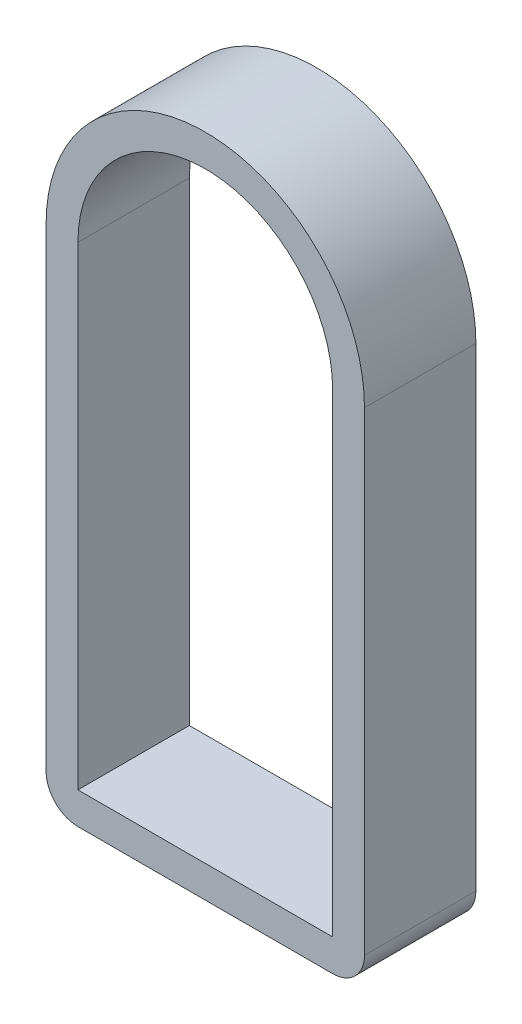
ISO-10303-21;
HEADER;
FILE_DESCRIPTION(('STEP AP214'),'2;1');
FILE_NAME('part.step','',(''),(''),'','','');
FILE_SCHEMA(('AUTOMOTIVE_DESIGN { 1 0 10303 214 1 1 1 1 }'));
ENDSEC;
DATA;
#1=APPLICATION_CONTEXT('core data for automotive mechanical design processes');
#2=APPLICATION_PROTOCOL_DEFINITION('international standard','automotive_design',2000,#1);
#3=PRODUCT_CONTEXT('',#1,'mechanical');
#4=PRODUCT('Part','Part','',(#3));
#5=PRODUCT_RELATED_PRODUCT_CATEGORY('part','',(#4));
#6=PRODUCT_DEFINITION_FORMATION('','',#4);
#7=PRODUCT_DEFINITION_CONTEXT('part definition',#1,'design');
#8=PRODUCT_DEFINITION('design','',#6,#7);
#9=PRODUCT_DEFINITION_SHAPE('','',#8);
#10=(LENGTH_UNIT() NAMED_UNIT(*) SI_UNIT(.MILLI.,.METRE.));
#11=(NAMED_UNIT(*) PLANE_ANGLE_UNIT() SI_UNIT($,.RADIAN.));
#12=(NAMED_UNIT(*) SI_UNIT($,.STERADIAN.) SOLID_ANGLE_UNIT());
#13=UNCERTAINTY_MEASURE_WITH_UNIT(LENGTH_MEASURE(1.E-05),#10,'distance_accuracy_value','');
#14=(GEOMETRIC_REPRESENTATION_CONTEXT(3) GLOBAL_UNCERTAINTY_ASSIGNED_CONTEXT((#13)) GLOBAL_UNIT_ASSIGNED_CONTEXT((#10,
#11,#12)) REPRESENTATION_CONTEXT('',''));
#15=CARTESIAN_POINT('',(0.,0.,0.));
#16=DIRECTION('',(0.,0.,1.));
#17=DIRECTION('',(1.,0.,0.));
#18=AXIS2_PLACEMENT_3D('',#15,#16,#17);
#19=CARTESIAN_POINT('',(0.,-5.71500000000012,0.));
#20=DIRECTION('',(0.,0.,1.));
#21=DIRECTION('',(1.,0.,0.));
#22=AXIS2_PLACEMENT_3D('',#19,#20,#21);
#23=CYLINDRICAL_SURFACE('',#22,1.);
#24=CARTESIAN_POINT('',(0.,-5.71500000000012,3.5));
#25=DIRECTION('',(0.,0.,-1.));
#26=DIRECTION('',(0.,-1.,0.));
#27=AXIS2_PLACEMENT_3D('',#24,#25,#26);
#28=CIRCLE('',#27,1.);
#29=CARTESIAN_POINT('',(0.999999999999999,-5.71500000000014,3.5));
#30=VERTEX_POINT('',#29);
#31=CARTESIAN_POINT('',(0.,-6.71500000000012,3.5));
#32=VERTEX_POINT('',#31);
#33=EDGE_CURVE('E11',#30,#32,#28,.T.);
#34=ORIENTED_EDGE('',*,*,#33,.T.);
#35=DIRECTION('',(0.,0.,-1.));
#36=VECTOR('',#35,1.);
#37=CARTESIAN_POINT('',(0.,-6.71500000000012,0.));
#38=LINE('',#37,#36);
#39=CARTESIAN_POINT('',(0.,-6.71500000000012,0.));
#40=VERTEX_POINT('',#39);
#41=EDGE_CURVE('E26',#32,#40,#38,.T.);
#42=ORIENTED_EDGE('',*,*,#41,.T.);
#43=CARTESIAN_POINT('',(0.,-5.71500000000012,0.));
#44=DIRECTION('',(0.,0.,1.));
#45=DIRECTION('',(1.,0.,0.));
#46=AXIS2_PLACEMENT_3D('',#43,#44,#45);
#47=CIRCLE('',#46,1.);
#48=CARTESIAN_POINT('',(0.999999999999999,-5.71500000000014,0.));
#49=VERTEX_POINT('',#48);
#50=EDGE_CURVE('E179',#40,#49,#47,.T.);
#51=ORIENTED_EDGE('',*,*,#50,.T.);
#52=DIRECTION('',(0.,0.,1.));
#53=VECTOR('',#52,1.);
#54=CARTESIAN_POINT('',(0.999999999999999,-5.71500000000014,0.));
#55=LINE('',#54,#53);
#56=EDGE_CURVE('E189',#49,#30,#55,.T.);
#57=ORIENTED_EDGE('',*,*,#56,.T.);
#58=EDGE_LOOP('',(#34,#42,#51,#57));
#59=FACE_BOUND('',#58,.T.);
#60=ADVANCED_FACE('F16',(#59),#23,.T.);
#61=CARTESIAN_POINT('',(0.999999999999984,-6.71500000000014,0.));
#62=DIRECTION('',(1.,0.,0.));
#63=DIRECTION('',(0.,1.,0.));
#64=AXIS2_PLACEMENT_3D('',#61,#62,#63);
#65=PLANE('',#64);
#66=ORIENTED_EDGE('',*,*,#56,.F.);
#67=DIRECTION('',(0.,1.,0.));
#68=VECTOR('',#67,1.);
#69=CARTESIAN_POINT('',(0.999999999999984,-6.71500000000014,0.));
#70=LINE('',#69,#68);
#71=CARTESIAN_POINT('',(1.00000000000023,9.17910161513774,0.));
#72=VERTEX_POINT('',#71);
#73=EDGE_CURVE('E191',#49,#72,#70,.T.);
#74=ORIENTED_EDGE('',*,*,#73,.T.);
#75=DIRECTION('',(0.,0.,1.));
#76=VECTOR('',#75,1.);
#77=CARTESIAN_POINT('',(1.00000000000023,9.17910161513774,0.));
#78=LINE('',#77,#76);
#79=CARTESIAN_POINT('',(1.00000000000023,9.17910161513774,3.5));
#80=VERTEX_POINT('',#79);
#81=EDGE_CURVE('E190',#72,#80,#78,.T.);
#82=ORIENTED_EDGE('',*,*,#81,.T.);
#83=DIRECTION('',(0.,1.,0.));
#84=VECTOR('',#83,1.);
#85=CARTESIAN_POINT('',(0.999999999999984,-6.71500000000014,3.5));
#86=LINE('',#85,#84);
#87=EDGE_CURVE('E116',#30,#80,#86,.T.);
#88=ORIENTED_EDGE('',*,*,#87,.F.);
#89=EDGE_LOOP('',(#66,#74,#82,#88));
#90=FACE_BOUND('',#89,.T.);
#91=ADVANCED_FACE('F187',(#90),#65,.T.);
#92=CARTESIAN_POINT('',(-3.99999999999988,2.19629543108497,0.));
#93=DIRECTION('',(0.,0.,1.));
#94=DIRECTION('',(1.,0.,0.));
#95=AXIS2_PLACEMENT_3D('',#92,#93,#94);
#96=PLANE('',#95);
#97=DIRECTION('',(1.,0.,0.));
#98=VECTOR('',#97,1.);
#99=CARTESIAN_POINT('',(-5.99999999999994,-5.715,0.));
#100=LINE('',#99,#98);
#101=CARTESIAN_POINT('',(-8.,-5.715,0.));
#102=VERTEX_POINT('',#101);
#103=CARTESIAN_POINT('',(0.,-5.715,0.));
#104=VERTEX_POINT('',#103);
#105=EDGE_CURVE('E155',#102,#104,#100,.T.);
#106=ORIENTED_EDGE('',*,*,#105,.T.);
#107=DIRECTION('',(0.,1.,0.));
#108=VECTOR('',#107,1.);
#109=CARTESIAN_POINT('',(0.,-1.75935228445755,0.));
#110=LINE('',#109,#108);
#111=CARTESIAN_POINT('',(2.28705943072782E-13,9.17910161513775,0.));
#112=VERTEX_POINT('',#111);
#113=EDGE_CURVE('E153',#104,#112,#110,.T.);
#114=ORIENTED_EDGE('',*,*,#113,.T.);
#115=CARTESIAN_POINT('',(-3.99999999999977,9.17910161513781,0.));
#116=DIRECTION('',(0.,0.,1.));
#117=DIRECTION('',(1.,0.,0.));
#118=AXIS2_PLACEMENT_3D('',#115,#116,#117);
#119=CIRCLE('',#118,4.);
#120=CARTESIAN_POINT('',(-7.99999999999977,9.17910161513788,0.));
#121=VERTEX_POINT('',#120);
#122=EDGE_CURVE('E104',#112,#121,#119,.T.);
#123=ORIENTED_EDGE('',*,*,#122,.T.);
#124=DIRECTION('',(0.,-1.,0.));
#125=VECTOR('',#124,1.);
#126=CARTESIAN_POINT('',(-7.99999999999983,5.68769852311145,0.));
#127=LINE('',#126,#125);
#128=EDGE_CURVE('E145',#121,#102,#127,.T.);
#129=ORIENTED_EDGE('',*,*,#128,.T.);
#130=EDGE_LOOP('',(#106,#114,#123,#129));
#131=FACE_BOUND('',#130,.T.);
#132=ORIENTED_EDGE('',*,*,#50,.F.);
#133=DIRECTION('',(1.,0.,0.));
#134=VECTOR('',#133,1.);
#135=CARTESIAN_POINT('',(-9.00000000000002,-6.71499999999998,0.));
#136=LINE('',#135,#134);
#137=CARTESIAN_POINT('',(-8.00000000000002,-6.715,0.));
#138=VERTEX_POINT('',#137);
#139=EDGE_CURVE('E121',#138,#40,#136,.T.);
#140=ORIENTED_EDGE('',*,*,#139,.F.);
#141=CARTESIAN_POINT('',(-8.,-5.715,0.));
#142=DIRECTION('',(0.,0.,1.));
#143=DIRECTION('',(1.,0.,0.));
#144=AXIS2_PLACEMENT_3D('',#141,#142,#143);
#145=CIRCLE('',#144,1.);
#146=CARTESIAN_POINT('',(-9.,-5.71499999999999,0.));
#147=VERTEX_POINT('',#146);
#148=EDGE_CURVE('E160',#147,#138,#145,.T.);
#149=ORIENTED_EDGE('',*,*,#148,.F.);
#150=DIRECTION('',(0.,-1.,0.));
#151=VECTOR('',#150,1.);
#152=CARTESIAN_POINT('',(-8.99999999999978,9.17910161513789,0.));
#153=LINE('',#152,#151);
#154=CARTESIAN_POINT('',(-8.99999999999978,9.17910161513789,0.));
#155=VERTEX_POINT('',#154);
#156=EDGE_CURVE('E138',#155,#147,#153,.T.);
#157=ORIENTED_EDGE('',*,*,#156,.F.);
#158=CARTESIAN_POINT('',(-3.99999999999977,9.17910161513781,0.));
#159=DIRECTION('',(0.,0.,1.));
#160=DIRECTION('',(1.,0.,0.));
#161=AXIS2_PLACEMENT_3D('',#158,#159,#160);
#162=CIRCLE('',#161,5.);
#163=EDGE_CURVE('E134',#72,#155,#162,.T.);
#164=ORIENTED_EDGE('',*,*,#163,.F.);
#165=ORIENTED_EDGE('',*,*,#73,.F.);
#166=EDGE_LOOP('',(#132,#140,#149,#157,#164,#165));
#167=FACE_BOUND('',#166,.T.);
#168=ADVANCED_FACE('F151',(#131,#167),#96,.F.);
#169=CARTESIAN_POINT('',(-8.,-5.715,0.));
#170=DIRECTION('',(0.,0.,1.));
#171=DIRECTION('',(1.,0.,0.));
#172=AXIS2_PLACEMENT_3D('',#169,#170,#171);
#173=CYLINDRICAL_SURFACE('',#172,1.);
#174=CARTESIAN_POINT('',(-8.,-5.715,3.5));
#175=DIRECTION('',(0.,0.,-1.));
#176=DIRECTION('',(0.,-1.,0.));
#177=AXIS2_PLACEMENT_3D('',#174,#175,#176);
#178=CIRCLE('',#177,1.);
#179=CARTESIAN_POINT('',(-8.00000000000002,-6.715,3.5));
#180=VERTEX_POINT('',#179);
#181=CARTESIAN_POINT('',(-9.,-5.71499999999999,3.5));
#182=VERTEX_POINT('',#181);
#183=EDGE_CURVE('E149',#180,#182,#178,.T.);
#184=ORIENTED_EDGE('',*,*,#183,.T.);
#185=DIRECTION('',(0.,0.,-1.));
#186=VECTOR('',#185,1.);
#187=CARTESIAN_POINT('',(-9.,-5.71499999999998,0.));
#188=LINE('',#187,#186);
#189=EDGE_CURVE('E163',#182,#147,#188,.T.);
#190=ORIENTED_EDGE('',*,*,#189,.T.);
#191=ORIENTED_EDGE('',*,*,#148,.T.);
#192=DIRECTION('',(0.,0.,1.));
#193=VECTOR('',#192,1.);
#194=CARTESIAN_POINT('',(-8.00000000000002,-6.715,0.));
#195=LINE('',#194,#193);
#196=EDGE_CURVE('E129',#138,#180,#195,.T.);
#197=ORIENTED_EDGE('',*,*,#196,.T.);
#198=EDGE_LOOP('',(#184,#190,#191,#197));
#199=FACE_BOUND('',#198,.T.);
#200=ADVANCED_FACE('F169',(#199),#173,.T.);
#201=CARTESIAN_POINT('',(-8.99999999999978,9.17910161513789,0.));
#202=DIRECTION('',(-1.,0.,0.));
#203=DIRECTION('',(0.,-1.,0.));
#204=AXIS2_PLACEMENT_3D('',#201,#202,#203);
#205=PLANE('',#204);
#206=ORIENTED_EDGE('',*,*,#189,.F.);
#207=DIRECTION('',(0.,-1.,0.));
#208=VECTOR('',#207,1.);
#209=CARTESIAN_POINT('',(-8.99999999999978,9.17910161513789,3.5));
#210=LINE('',#209,#208);
#211=CARTESIAN_POINT('',(-8.99999999999978,9.17910161513789,3.5));
#212=VERTEX_POINT('',#211);
#213=EDGE_CURVE('E117',#212,#182,#210,.T.);
#214=ORIENTED_EDGE('',*,*,#213,.F.);
#215=DIRECTION('',(0.,0.,1.));
#216=VECTOR('',#215,1.);
#217=CARTESIAN_POINT('',(-8.99999999999978,9.17910161513789,0.));
#218=LINE('',#217,#216);
#219=EDGE_CURVE('E131',#155,#212,#218,.T.);
#220=ORIENTED_EDGE('',*,*,#219,.F.);
#221=ORIENTED_EDGE('',*,*,#156,.T.);
#222=EDGE_LOOP('',(#206,#214,#220,#221));
#223=FACE_BOUND('',#222,.T.);
#224=ADVANCED_FACE('F173',(#223),#205,.T.);
#225=CARTESIAN_POINT('',(-8.,-5.715,0.));
#226=DIRECTION('',(0.,-1.,0.));
#227=DIRECTION('',(0.,0.,-1.));
#228=AXIS2_PLACEMENT_3D('',#225,#226,#227);
#229=PLANE('',#228);
#230=ORIENTED_EDGE('',*,*,#105,.F.);
#231=DIRECTION('',(0.,0.,1.));
#232=VECTOR('',#231,1.);
#233=CARTESIAN_POINT('',(-8.,-5.715,0.));
#234=LINE('',#233,#232);
#235=CARTESIAN_POINT('',(-8.,-5.715,3.5));
#236=VERTEX_POINT('',#235);
#237=EDGE_CURVE('E135',#102,#236,#234,.T.);
#238=ORIENTED_EDGE('',*,*,#237,.T.);
#239=DIRECTION('',(-1.,0.,0.));
#240=VECTOR('',#239,1.);
#241=CARTESIAN_POINT('',(-5.99999999999994,-5.715,3.5));
#242=LINE('',#241,#240);
#243=CARTESIAN_POINT('',(0.,-5.715,3.5));
#244=VERTEX_POINT('',#243);
#245=EDGE_CURVE('E126',#244,#236,#242,.T.);
#246=ORIENTED_EDGE('',*,*,#245,.F.);
#247=DIRECTION('',(0.,0.,1.));
#248=VECTOR('',#247,1.);
#249=CARTESIAN_POINT('',(0.,-5.715,0.));
#250=LINE('',#249,#248);
#251=EDGE_CURVE('E108',#104,#244,#250,.T.);
#252=ORIENTED_EDGE('',*,*,#251,.F.);
#253=EDGE_LOOP('',(#230,#238,#246,#252));
#254=FACE_BOUND('',#253,.T.);
#255=ADVANCED_FACE('F199',(#254),#229,.F.);
#256=CARTESIAN_POINT('',(-7.99999999999977,9.17910161513788,0.));
#257=DIRECTION('',(-1.,0.,0.));
#258=DIRECTION('',(0.,-1.,0.));
#259=AXIS2_PLACEMENT_3D('',#256,#257,#258);
#260=PLANE('',#259);
#261=ORIENTED_EDGE('',*,*,#128,.F.);
#262=DIRECTION('',(0.,0.,1.));
#263=VECTOR('',#262,1.);
#264=CARTESIAN_POINT('',(-7.99999999999977,9.17910161513788,0.));
#265=LINE('',#264,#263);
#266=CARTESIAN_POINT('',(-7.99999999999977,9.17910161513788,3.5));
#267=VERTEX_POINT('',#266);
#268=EDGE_CURVE('E107',#121,#267,#265,.T.);
#269=ORIENTED_EDGE('',*,*,#268,.T.);
#270=DIRECTION('',(0.,1.,0.));
#271=VECTOR('',#270,1.);
#272=CARTESIAN_POINT('',(-7.99999999999983,5.68769852311145,3.5));
#273=LINE('',#272,#271);
#274=EDGE_CURVE('E89',#236,#267,#273,.T.);
#275=ORIENTED_EDGE('',*,*,#274,.F.);
#276=ORIENTED_EDGE('',*,*,#237,.F.);
#277=EDGE_LOOP('',(#261,#269,#275,#276));
#278=FACE_BOUND('',#277,.T.);
#279=ADVANCED_FACE('F143',(#278),#260,.F.);
#280=CARTESIAN_POINT('',(-3.99999999999977,9.17910161513781,0.));
#281=DIRECTION('',(0.,0.,1.));
#282=DIRECTION('',(1.,0.,0.));
#283=AXIS2_PLACEMENT_3D('',#280,#281,#282);
#284=CYLINDRICAL_SURFACE('',#283,4.);
#285=ORIENTED_EDGE('',*,*,#122,.F.);
#286=DIRECTION('',(0.,0.,1.));
#287=VECTOR('',#286,1.);
#288=CARTESIAN_POINT('',(2.28705943072782E-13,9.17910161513775,0.));
#289=LINE('',#288,#287);
#290=CARTESIAN_POINT('',(2.28705943072782E-13,9.17910161513775,3.5));
#291=VERTEX_POINT('',#290);
#292=EDGE_CURVE('E102',#112,#291,#289,.T.);
#293=ORIENTED_EDGE('',*,*,#292,.T.);
#294=CARTESIAN_POINT('',(-3.99999999999977,9.17910161513781,3.5));
#295=DIRECTION('',(0.,0.,-1.));
#296=DIRECTION('',(0.,-1.,0.));
#297=AXIS2_PLACEMENT_3D('',#294,#295,#296);
#298=CIRCLE('',#297,4.);
#299=EDGE_CURVE('E93',#267,#291,#298,.T.);
#300=ORIENTED_EDGE('',*,*,#299,.F.);
#301=ORIENTED_EDGE('',*,*,#268,.F.);
#302=EDGE_LOOP('',(#285,#293,#300,#301));
#303=FACE_BOUND('',#302,.T.);
#304=ADVANCED_FACE('F18',(#303),#284,.F.);
#305=CARTESIAN_POINT('',(0.,-5.715,0.));
#306=DIRECTION('',(1.,0.,0.));
#307=DIRECTION('',(0.,1.,0.));
#308=AXIS2_PLACEMENT_3D('',#305,#306,#307);
#309=PLANE('',#308);
#310=ORIENTED_EDGE('',*,*,#113,.F.);
#311=ORIENTED_EDGE('',*,*,#251,.T.);
#312=DIRECTION('',(0.,-1.,0.));
#313=VECTOR('',#312,1.);
#314=CARTESIAN_POINT('',(0.,-1.75935228445755,3.5));
#315=LINE('',#314,#313);
#316=EDGE_CURVE('E97',#291,#244,#315,.T.);
#317=ORIENTED_EDGE('',*,*,#316,.F.);
#318=ORIENTED_EDGE('',*,*,#292,.F.);
#319=EDGE_LOOP('',(#310,#311,#317,#318));
#320=FACE_BOUND('',#319,.T.);
#321=ADVANCED_FACE('F111',(#320),#309,.F.);
#322=CARTESIAN_POINT('',(-3.99999999999977,9.17910161513781,0.));
#323=DIRECTION('',(0.,0.,1.));
#324=DIRECTION('',(1.,0.,0.));
#325=AXIS2_PLACEMENT_3D('',#322,#323,#324);
#326=CYLINDRICAL_SURFACE('',#325,5.);
#327=ORIENTED_EDGE('',*,*,#163,.T.);
#328=ORIENTED_EDGE('',*,*,#219,.T.);
#329=CARTESIAN_POINT('',(-3.99999999999977,9.17910161513781,3.5));
#330=DIRECTION('',(0.,0.,1.));
#331=DIRECTION('',(1.,0.,0.));
#332=AXIS2_PLACEMENT_3D('',#329,#330,#331);
#333=CIRCLE('',#332,5.);
#334=EDGE_CURVE('E114',#80,#212,#333,.T.);
#335=ORIENTED_EDGE('',*,*,#334,.F.);
#336=ORIENTED_EDGE('',*,*,#81,.F.);
#337=EDGE_LOOP('',(#327,#328,#335,#336));
#338=FACE_BOUND('',#337,.T.);
#339=ADVANCED_FACE('F194',(#338),#326,.T.);
#340=CARTESIAN_POINT('',(-9.00000000000002,-6.71499999999998,0.));
#341=DIRECTION('',(0.,-1.,0.));
#342=DIRECTION('',(1.,0.,0.));
#343=AXIS2_PLACEMENT_3D('',#340,#341,#342);
#344=PLANE('',#343);
#345=ORIENTED_EDGE('',*,*,#41,.F.);
#346=DIRECTION('',(1.,0.,0.));
#347=VECTOR('',#346,1.);
#348=CARTESIAN_POINT('',(-9.00000000000002,-6.71499999999998,3.5));
#349=LINE('',#348,#347);
#350=EDGE_CURVE('E20',#180,#32,#349,.T.);
#351=ORIENTED_EDGE('',*,*,#350,.F.);
#352=ORIENTED_EDGE('',*,*,#196,.F.);
#353=ORIENTED_EDGE('',*,*,#139,.T.);
#354=EDGE_LOOP('',(#345,#351,#352,#353));
#355=FACE_BOUND('',#354,.T.);
#356=ADVANCED_FACE('F180',(#355),#344,.T.);
#357=CARTESIAN_POINT('',(-3.99999999999988,2.19629543108497,3.5));
#358=DIRECTION('',(0.,0.,1.));
#359=DIRECTION('',(1.,0.,0.));
#360=AXIS2_PLACEMENT_3D('',#357,#358,#359);
#361=PLANE('',#360);
#362=ORIENTED_EDGE('',*,*,#33,.F.);
#363=ORIENTED_EDGE('',*,*,#87,.T.);
#364=ORIENTED_EDGE('',*,*,#334,.T.);
#365=ORIENTED_EDGE('',*,*,#213,.T.);
#366=ORIENTED_EDGE('',*,*,#183,.F.);
#367=ORIENTED_EDGE('',*,*,#350,.T.);
#368=EDGE_LOOP('',(#362,#363,#364,#365,#366,#367));
#369=FACE_BOUND('',#368,.T.);
#370=ORIENTED_EDGE('',*,*,#245,.T.);
#371=ORIENTED_EDGE('',*,*,#274,.T.);
#372=ORIENTED_EDGE('',*,*,#299,.T.);
#373=ORIENTED_EDGE('',*,*,#316,.T.);
#374=EDGE_LOOP('',(#370,#371,#372,#373));
#375=FACE_BOUND('',#374,.T.);
#376=ADVANCED_FACE('F95',(#369,#375),#361,.T.);
#377=CLOSED_SHELL('',(#60,#91,#168,#200,#224,#255,#279,#304,#321,#339,#356,#376));
#378=MANIFOLD_SOLID_BREP('B1',#377);
#379=ADVANCED_BREP_SHAPE_REPRESENTATION('',(#18,#378),#14);
#380=SHAPE_DEFINITION_REPRESENTATION(#9,#379);
ENDSEC;
END-ISO-10303-21;
